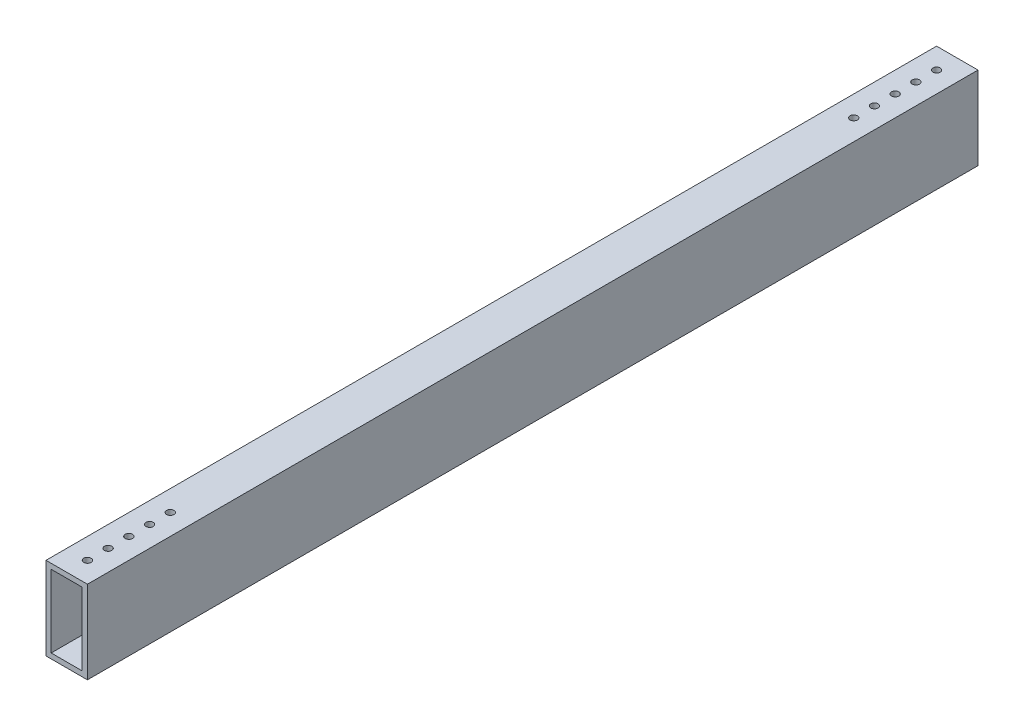
ISO-10303-21;
HEADER;
FILE_DESCRIPTION(('STEP AP214'),'2;1');
FILE_NAME('part.step','',(''),(''),'','','');
FILE_SCHEMA(('AUTOMOTIVE_DESIGN { 1 0 10303 214 1 1 1 1 }'));
ENDSEC;
DATA;
#1=APPLICATION_CONTEXT('core data for automotive mechanical design processes');
#2=APPLICATION_PROTOCOL_DEFINITION('international standard','automotive_design',2000,#1);
#3=PRODUCT_CONTEXT('',#1,'mechanical');
#4=PRODUCT('Part','Part','',(#3));
#5=PRODUCT_RELATED_PRODUCT_CATEGORY('part','',(#4));
#6=PRODUCT_DEFINITION_FORMATION('','',#4);
#7=PRODUCT_DEFINITION_CONTEXT('part definition',#1,'design');
#8=PRODUCT_DEFINITION('design','',#6,#7);
#9=PRODUCT_DEFINITION_SHAPE('','',#8);
#10=(LENGTH_UNIT() NAMED_UNIT(*) SI_UNIT(.MILLI.,.METRE.));
#11=(NAMED_UNIT(*) PLANE_ANGLE_UNIT() SI_UNIT($,.RADIAN.));
#12=(NAMED_UNIT(*) SI_UNIT($,.STERADIAN.) SOLID_ANGLE_UNIT());
#13=UNCERTAINTY_MEASURE_WITH_UNIT(LENGTH_MEASURE(1.E-05),#10,'distance_accuracy_value','');
#14=(GEOMETRIC_REPRESENTATION_CONTEXT(3) GLOBAL_UNCERTAINTY_ASSIGNED_CONTEXT((#13)) GLOBAL_UNIT_ASSIGNED_CONTEXT((#10,
#11,#12)) REPRESENTATION_CONTEXT('',''));
#15=CARTESIAN_POINT('',(0.,0.,0.));
#16=DIRECTION('',(0.,0.,1.));
#17=DIRECTION('',(1.,0.,0.));
#18=AXIS2_PLACEMENT_3D('',#15,#16,#17);
#19=CARTESIAN_POINT('',(0.,0.,273.05));
#20=DIRECTION('',(0.,0.,-1.));
#21=DIRECTION('',(-1.,0.,0.));
#22=AXIS2_PLACEMENT_3D('',#19,#20,#21);
#23=PLANE('',#22);
#24=DIRECTION('',(0.,-1.,0.));
#25=VECTOR('',#24,1.);
#26=CARTESIAN_POINT('',(0.,0.,273.05));
#27=LINE('',#26,#25);
#28=CARTESIAN_POINT('',(0.,50.8,273.05));
#29=VERTEX_POINT('',#28);
#30=CARTESIAN_POINT('',(0.,0.,273.05));
#31=VERTEX_POINT('',#30);
#32=EDGE_CURVE('E159',#29,#31,#27,.T.);
#33=ORIENTED_EDGE('',*,*,#32,.T.);
#34=DIRECTION('',(1.,0.,0.));
#35=VECTOR('',#34,1.);
#36=CARTESIAN_POINT('',(0.,0.,273.05));
#37=LINE('',#36,#35);
#38=CARTESIAN_POINT('',(25.4,0.,273.05));
#39=VERTEX_POINT('',#38);
#40=EDGE_CURVE('E163',#31,#39,#37,.T.);
#41=ORIENTED_EDGE('',*,*,#40,.T.);
#42=DIRECTION('',(0.,1.,0.));
#43=VECTOR('',#42,1.);
#44=CARTESIAN_POINT('',(25.4,0.,273.05));
#45=LINE('',#44,#43);
#46=CARTESIAN_POINT('',(25.4,50.8,273.05));
#47=VERTEX_POINT('',#46);
#48=EDGE_CURVE('E167',#39,#47,#45,.T.);
#49=ORIENTED_EDGE('',*,*,#48,.T.);
#50=DIRECTION('',(-1.,0.,0.));
#51=VECTOR('',#50,1.);
#52=CARTESIAN_POINT('',(0.,50.8,273.05));
#53=LINE('',#52,#51);
#54=EDGE_CURVE('E170',#47,#29,#53,.T.);
#55=ORIENTED_EDGE('',*,*,#54,.T.);
#56=EDGE_LOOP('',(#33,#41,#49,#55));
#57=FACE_BOUND('',#56,.T.);
#58=DIRECTION('',(0.,-1.,0.));
#59=VECTOR('',#58,1.);
#60=CARTESIAN_POINT('',(3.175,3.175,273.05));
#61=LINE('',#60,#59);
#62=CARTESIAN_POINT('',(3.175,47.625,273.05));
#63=VERTEX_POINT('',#62);
#64=CARTESIAN_POINT('',(3.175,3.175,273.05));
#65=VERTEX_POINT('',#64);
#66=EDGE_CURVE('E108',#63,#65,#61,.T.);
#67=ORIENTED_EDGE('',*,*,#66,.F.);
#68=DIRECTION('',(-1.,0.,0.));
#69=VECTOR('',#68,1.);
#70=CARTESIAN_POINT('',(3.175,47.625,273.05));
#71=LINE('',#70,#69);
#72=CARTESIAN_POINT('',(22.225,47.625,273.05));
#73=VERTEX_POINT('',#72);
#74=EDGE_CURVE('E135',#73,#63,#71,.T.);
#75=ORIENTED_EDGE('',*,*,#74,.F.);
#76=DIRECTION('',(0.,1.,0.));
#77=VECTOR('',#76,1.);
#78=CARTESIAN_POINT('',(22.225,3.175,273.05));
#79=LINE('',#78,#77);
#80=CARTESIAN_POINT('',(22.225,3.175,273.05));
#81=VERTEX_POINT('',#80);
#82=EDGE_CURVE('E130',#81,#73,#79,.T.);
#83=ORIENTED_EDGE('',*,*,#82,.F.);
#84=DIRECTION('',(1.,0.,0.));
#85=VECTOR('',#84,1.);
#86=CARTESIAN_POINT('',(3.175,3.175,273.05));
#87=LINE('',#86,#85);
#88=EDGE_CURVE('E117',#65,#81,#87,.T.);
#89=ORIENTED_EDGE('',*,*,#88,.F.);
#90=EDGE_LOOP('',(#67,#75,#83,#89));
#91=FACE_BOUND('',#90,.T.);
#92=ADVANCED_FACE('F40',(#57,#91),#23,.F.);
#93=CARTESIAN_POINT('',(0.,0.,-273.05));
#94=DIRECTION('',(0.,0.,-1.));
#95=DIRECTION('',(-1.,0.,0.));
#96=AXIS2_PLACEMENT_3D('',#93,#94,#95);
#97=PLANE('',#96);
#98=DIRECTION('',(0.,-1.,0.));
#99=VECTOR('',#98,1.);
#100=CARTESIAN_POINT('',(0.,0.,-273.05));
#101=LINE('',#100,#99);
#102=CARTESIAN_POINT('',(0.,50.8,-273.05));
#103=VERTEX_POINT('',#102);
#104=CARTESIAN_POINT('',(0.,0.,-273.05));
#105=VERTEX_POINT('',#104);
#106=EDGE_CURVE('E126',#103,#105,#101,.T.);
#107=ORIENTED_EDGE('',*,*,#106,.F.);
#108=DIRECTION('',(-1.,0.,0.));
#109=VECTOR('',#108,1.);
#110=CARTESIAN_POINT('',(0.,50.8,-273.05));
#111=LINE('',#110,#109);
#112=CARTESIAN_POINT('',(25.4,50.8,-273.05));
#113=VERTEX_POINT('',#112);
#114=EDGE_CURVE('E164',#113,#103,#111,.T.);
#115=ORIENTED_EDGE('',*,*,#114,.F.);
#116=DIRECTION('',(0.,1.,0.));
#117=VECTOR('',#116,1.);
#118=CARTESIAN_POINT('',(25.4,0.,-273.05));
#119=LINE('',#118,#117);
#120=CARTESIAN_POINT('',(25.4,0.,-273.05));
#121=VERTEX_POINT('',#120);
#122=EDGE_CURVE('E180',#121,#113,#119,.T.);
#123=ORIENTED_EDGE('',*,*,#122,.F.);
#124=DIRECTION('',(1.,0.,0.));
#125=VECTOR('',#124,1.);
#126=CARTESIAN_POINT('',(0.,0.,-273.05));
#127=LINE('',#126,#125);
#128=EDGE_CURVE('E177',#105,#121,#127,.T.);
#129=ORIENTED_EDGE('',*,*,#128,.F.);
#130=EDGE_LOOP('',(#107,#115,#123,#129));
#131=FACE_BOUND('',#130,.T.);
#132=DIRECTION('',(-1.,0.,0.));
#133=VECTOR('',#132,1.);
#134=CARTESIAN_POINT('',(3.175,47.625,-273.05));
#135=LINE('',#134,#133);
#136=CARTESIAN_POINT('',(22.225,47.625,-273.05));
#137=VERTEX_POINT('',#136);
#138=CARTESIAN_POINT('',(3.175,47.625,-273.05));
#139=VERTEX_POINT('',#138);
#140=EDGE_CURVE('E118',#137,#139,#135,.T.);
#141=ORIENTED_EDGE('',*,*,#140,.T.);
#142=DIRECTION('',(0.,-1.,0.));
#143=VECTOR('',#142,1.);
#144=CARTESIAN_POINT('',(3.175,3.175,-273.05));
#145=LINE('',#144,#143);
#146=CARTESIAN_POINT('',(3.175,3.175,-273.05));
#147=VERTEX_POINT('',#146);
#148=EDGE_CURVE('E66',#139,#147,#145,.T.);
#149=ORIENTED_EDGE('',*,*,#148,.T.);
#150=DIRECTION('',(1.,0.,0.));
#151=VECTOR('',#150,1.);
#152=CARTESIAN_POINT('',(3.175,3.175,-273.05));
#153=LINE('',#152,#151);
#154=CARTESIAN_POINT('',(22.225,3.175,-273.05));
#155=VERTEX_POINT('',#154);
#156=EDGE_CURVE('E124',#147,#155,#153,.T.);
#157=ORIENTED_EDGE('',*,*,#156,.T.);
#158=DIRECTION('',(0.,1.,0.));
#159=VECTOR('',#158,1.);
#160=CARTESIAN_POINT('',(22.225,3.175,-273.05));
#161=LINE('',#160,#159);
#162=EDGE_CURVE('E146',#155,#137,#161,.T.);
#163=ORIENTED_EDGE('',*,*,#162,.T.);
#164=EDGE_LOOP('',(#141,#149,#157,#163));
#165=FACE_BOUND('',#164,.T.);
#166=ADVANCED_FACE('F318',(#131,#165),#97,.T.);
#167=CARTESIAN_POINT('',(0.,0.,273.05));
#168=DIRECTION('',(1.,0.,0.));
#169=DIRECTION('',(0.,0.,-1.));
#170=AXIS2_PLACEMENT_3D('',#167,#168,#169);
#171=PLANE('',#170);
#172=ORIENTED_EDGE('',*,*,#106,.T.);
#173=DIRECTION('',(0.,0.,-1.));
#174=VECTOR('',#173,1.);
#175=CARTESIAN_POINT('',(0.,0.,273.05));
#176=LINE('',#175,#174);
#177=EDGE_CURVE('E11',#31,#105,#176,.T.);
#178=ORIENTED_EDGE('',*,*,#177,.F.);
#179=ORIENTED_EDGE('',*,*,#32,.F.);
#180=DIRECTION('',(0.,0.,-1.));
#181=VECTOR('',#180,1.);
#182=CARTESIAN_POINT('',(0.,50.8,273.05));
#183=LINE('',#182,#181);
#184=EDGE_CURVE('E173',#29,#103,#183,.T.);
#185=ORIENTED_EDGE('',*,*,#184,.T.);
#186=EDGE_LOOP('',(#172,#178,#179,#185));
#187=FACE_BOUND('',#186,.T.);
#188=ADVANCED_FACE('F42',(#187),#171,.F.);
#189=CARTESIAN_POINT('',(0.,0.,273.05));
#190=DIRECTION('',(0.,1.,0.));
#191=DIRECTION('',(0.,0.,1.));
#192=AXIS2_PLACEMENT_3D('',#189,#190,#191);
#193=PLANE('',#192);
#194=CARTESIAN_POINT('',(12.7,0.,260.35));
#195=DIRECTION('',(0.,-1.,0.));
#196=DIRECTION('',(0.,0.,-1.));
#197=AXIS2_PLACEMENT_3D('',#194,#195,#196);
#198=CIRCLE('',#197,2.24789999999998);
#199=CARTESIAN_POINT('',(12.7,0.,258.1021));
#200=VERTEX_POINT('',#199);
#201=EDGE_CURVE('E275',#200,#200,#198,.T.);
#202=ORIENTED_EDGE('',*,*,#201,.F.);
#203=EDGE_LOOP('',(#202));
#204=FACE_BOUND('',#203,.T.);
#205=CARTESIAN_POINT('',(12.7,0.,234.95));
#206=DIRECTION('',(0.,-1.,0.));
#207=DIRECTION('',(0.,0.,-1.));
#208=AXIS2_PLACEMENT_3D('',#205,#206,#207);
#209=CIRCLE('',#208,2.24789999999998);
#210=CARTESIAN_POINT('',(12.7,0.,232.7021));
#211=VERTEX_POINT('',#210);
#212=EDGE_CURVE('E253',#211,#211,#209,.T.);
#213=ORIENTED_EDGE('',*,*,#212,.F.);
#214=EDGE_LOOP('',(#213));
#215=FACE_BOUND('',#214,.T.);
#216=CARTESIAN_POINT('',(12.7,0.,209.55));
#217=DIRECTION('',(0.,-1.,0.));
#218=DIRECTION('',(0.,0.,-1.));
#219=AXIS2_PLACEMENT_3D('',#216,#217,#218);
#220=CIRCLE('',#219,2.24789999999998);
#221=CARTESIAN_POINT('',(12.7,0.,207.3021));
#222=VERTEX_POINT('',#221);
#223=EDGE_CURVE('E243',#222,#222,#220,.T.);
#224=ORIENTED_EDGE('',*,*,#223,.F.);
#225=EDGE_LOOP('',(#224));
#226=FACE_BOUND('',#225,.T.);
#227=CARTESIAN_POINT('',(12.7,0.,-260.35));
#228=DIRECTION('',(0.,1.,0.));
#229=DIRECTION('',(0.,0.,1.));
#230=AXIS2_PLACEMENT_3D('',#227,#228,#229);
#231=CIRCLE('',#230,2.24789999999998);
#232=CARTESIAN_POINT('',(12.7,0.,-258.1021));
#233=VERTEX_POINT('',#232);
#234=EDGE_CURVE('E276',#233,#233,#231,.T.);
#235=ORIENTED_EDGE('',*,*,#234,.T.);
#236=EDGE_LOOP('',(#235));
#237=FACE_BOUND('',#236,.T.);
#238=CARTESIAN_POINT('',(12.7,0.,-234.95));
#239=DIRECTION('',(0.,1.,0.));
#240=DIRECTION('',(0.,0.,1.));
#241=AXIS2_PLACEMENT_3D('',#238,#239,#240);
#242=CIRCLE('',#241,2.24789999999998);
#243=CARTESIAN_POINT('',(12.7,0.,-232.7021));
#244=VERTEX_POINT('',#243);
#245=EDGE_CURVE('E284',#244,#244,#242,.T.);
#246=ORIENTED_EDGE('',*,*,#245,.T.);
#247=EDGE_LOOP('',(#246));
#248=FACE_BOUND('',#247,.T.);
#249=CARTESIAN_POINT('',(12.7,0.,-209.55));
#250=DIRECTION('',(0.,1.,0.));
#251=DIRECTION('',(0.,0.,1.));
#252=AXIS2_PLACEMENT_3D('',#249,#250,#251);
#253=CIRCLE('',#252,2.24789999999998);
#254=CARTESIAN_POINT('',(12.7,0.,-207.3021));
#255=VERTEX_POINT('',#254);
#256=EDGE_CURVE('E216',#255,#255,#253,.T.);
#257=ORIENTED_EDGE('',*,*,#256,.T.);
#258=EDGE_LOOP('',(#257));
#259=FACE_BOUND('',#258,.T.);
#260=ORIENTED_EDGE('',*,*,#128,.T.);
#261=DIRECTION('',(0.,0.,-1.));
#262=VECTOR('',#261,1.);
#263=CARTESIAN_POINT('',(25.4,0.,273.05));
#264=LINE('',#263,#262);
#265=EDGE_CURVE('E50',#39,#121,#264,.T.);
#266=ORIENTED_EDGE('',*,*,#265,.F.);
#267=ORIENTED_EDGE('',*,*,#40,.F.);
#268=ORIENTED_EDGE('',*,*,#177,.T.);
#269=EDGE_LOOP('',(#260,#266,#267,#268));
#270=FACE_BOUND('',#269,.T.);
#271=ADVANCED_FACE('F332',(#204,#215,#226,#237,#248,#259,#270),#193,.F.);
#272=CARTESIAN_POINT('',(25.4,0.,273.05));
#273=DIRECTION('',(-1.,0.,0.));
#274=DIRECTION('',(0.,0.,1.));
#275=AXIS2_PLACEMENT_3D('',#272,#273,#274);
#276=PLANE('',#275);
#277=ORIENTED_EDGE('',*,*,#122,.T.);
#278=DIRECTION('',(0.,0.,-1.));
#279=VECTOR('',#278,1.);
#280=CARTESIAN_POINT('',(25.4,50.8,273.05));
#281=LINE('',#280,#279);
#282=EDGE_CURVE('E188',#47,#113,#281,.T.);
#283=ORIENTED_EDGE('',*,*,#282,.F.);
#284=ORIENTED_EDGE('',*,*,#48,.F.);
#285=ORIENTED_EDGE('',*,*,#265,.T.);
#286=EDGE_LOOP('',(#277,#283,#284,#285));
#287=FACE_BOUND('',#286,.T.);
#288=ADVANCED_FACE('F329',(#287),#276,.F.);
#289=CARTESIAN_POINT('',(0.,50.8,273.05));
#290=DIRECTION('',(0.,-1.,0.));
#291=DIRECTION('',(0.,0.,-1.));
#292=AXIS2_PLACEMENT_3D('',#289,#290,#291);
#293=PLANE('',#292);
#294=CARTESIAN_POINT('',(12.7,50.8,260.35));
#295=DIRECTION('',(0.,1.,0.));
#296=DIRECTION('',(0.,0.,1.));
#297=AXIS2_PLACEMENT_3D('',#294,#295,#296);
#298=CIRCLE('',#297,2.24789999999998);
#299=CARTESIAN_POINT('',(12.7,50.8,262.5979));
#300=VERTEX_POINT('',#299);
#301=EDGE_CURVE('E222',#300,#300,#298,.T.);
#302=ORIENTED_EDGE('',*,*,#301,.F.);
#303=EDGE_LOOP('',(#302));
#304=FACE_BOUND('',#303,.T.);
#305=CARTESIAN_POINT('',(12.7,50.8,247.65));
#306=DIRECTION('',(0.,1.,0.));
#307=DIRECTION('',(0.,0.,1.));
#308=AXIS2_PLACEMENT_3D('',#305,#306,#307);
#309=CIRCLE('',#308,2.24789999999998);
#310=CARTESIAN_POINT('',(12.7,50.8,249.8979));
#311=VERTEX_POINT('',#310);
#312=EDGE_CURVE('E439',#311,#311,#309,.T.);
#313=ORIENTED_EDGE('',*,*,#312,.F.);
#314=EDGE_LOOP('',(#313));
#315=FACE_BOUND('',#314,.T.);
#316=CARTESIAN_POINT('',(12.7,50.8,234.95));
#317=DIRECTION('',(0.,1.,0.));
#318=DIRECTION('',(0.,0.,1.));
#319=AXIS2_PLACEMENT_3D('',#316,#317,#318);
#320=CIRCLE('',#319,2.24789999999998);
#321=CARTESIAN_POINT('',(12.7,50.8,237.1979));
#322=VERTEX_POINT('',#321);
#323=EDGE_CURVE('E444',#322,#322,#320,.T.);
#324=ORIENTED_EDGE('',*,*,#323,.F.);
#325=EDGE_LOOP('',(#324));
#326=FACE_BOUND('',#325,.T.);
#327=CARTESIAN_POINT('',(12.7,50.8,222.25));
#328=DIRECTION('',(0.,1.,0.));
#329=DIRECTION('',(0.,0.,1.));
#330=AXIS2_PLACEMENT_3D('',#327,#328,#329);
#331=CIRCLE('',#330,2.24789999999998);
#332=CARTESIAN_POINT('',(12.7,50.8,224.4979));
#333=VERTEX_POINT('',#332);
#334=EDGE_CURVE('E450',#333,#333,#331,.T.);
#335=ORIENTED_EDGE('',*,*,#334,.F.);
#336=EDGE_LOOP('',(#335));
#337=FACE_BOUND('',#336,.T.);
#338=CARTESIAN_POINT('',(12.7,50.8,209.55));
#339=DIRECTION('',(0.,1.,0.));
#340=DIRECTION('',(0.,0.,1.));
#341=AXIS2_PLACEMENT_3D('',#338,#339,#340);
#342=CIRCLE('',#341,2.24789999999998);
#343=CARTESIAN_POINT('',(12.7,50.8,211.7979));
#344=VERTEX_POINT('',#343);
#345=EDGE_CURVE('E454',#344,#344,#342,.T.);
#346=ORIENTED_EDGE('',*,*,#345,.F.);
#347=EDGE_LOOP('',(#346));
#348=FACE_BOUND('',#347,.T.);
#349=CARTESIAN_POINT('',(12.7,50.8,-260.35));
#350=DIRECTION('',(0.,1.,0.));
#351=DIRECTION('',(0.,0.,1.));
#352=AXIS2_PLACEMENT_3D('',#349,#350,#351);
#353=CIRCLE('',#352,2.24789999999998);
#354=CARTESIAN_POINT('',(12.7,50.8,-258.1021));
#355=VERTEX_POINT('',#354);
#356=EDGE_CURVE('E200',#355,#355,#353,.T.);
#357=ORIENTED_EDGE('',*,*,#356,.F.);
#358=EDGE_LOOP('',(#357));
#359=FACE_BOUND('',#358,.T.);
#360=CARTESIAN_POINT('',(12.7,50.8,-247.65));
#361=DIRECTION('',(0.,1.,0.));
#362=DIRECTION('',(0.,0.,1.));
#363=AXIS2_PLACEMENT_3D('',#360,#361,#362);
#364=CIRCLE('',#363,2.24789999999998);
#365=CARTESIAN_POINT('',(12.7,50.8,-245.4021));
#366=VERTEX_POINT('',#365);
#367=EDGE_CURVE('E259',#366,#366,#364,.T.);
#368=ORIENTED_EDGE('',*,*,#367,.F.);
#369=EDGE_LOOP('',(#368));
#370=FACE_BOUND('',#369,.T.);
#371=CARTESIAN_POINT('',(12.7,50.8,-234.95));
#372=DIRECTION('',(0.,1.,0.));
#373=DIRECTION('',(0.,0.,1.));
#374=AXIS2_PLACEMENT_3D('',#371,#372,#373);
#375=CIRCLE('',#374,2.24789999999998);
#376=CARTESIAN_POINT('',(12.7,50.8,-232.7021));
#377=VERTEX_POINT('',#376);
#378=EDGE_CURVE('E263',#377,#377,#375,.T.);
#379=ORIENTED_EDGE('',*,*,#378,.F.);
#380=EDGE_LOOP('',(#379));
#381=FACE_BOUND('',#380,.T.);
#382=CARTESIAN_POINT('',(12.7,50.8,-222.25));
#383=DIRECTION('',(0.,1.,0.));
#384=DIRECTION('',(0.,0.,1.));
#385=AXIS2_PLACEMENT_3D('',#382,#383,#384);
#386=CIRCLE('',#385,2.24789999999998);
#387=CARTESIAN_POINT('',(12.7,50.8,-220.0021));
#388=VERTEX_POINT('',#387);
#389=EDGE_CURVE('E267',#388,#388,#386,.T.);
#390=ORIENTED_EDGE('',*,*,#389,.F.);
#391=EDGE_LOOP('',(#390));
#392=FACE_BOUND('',#391,.T.);
#393=CARTESIAN_POINT('',(12.7,50.8,-209.55));
#394=DIRECTION('',(0.,1.,0.));
#395=DIRECTION('',(0.,0.,1.));
#396=AXIS2_PLACEMENT_3D('',#393,#394,#395);
#397=CIRCLE('',#396,2.24789999999998);
#398=CARTESIAN_POINT('',(12.7,50.8,-207.3021));
#399=VERTEX_POINT('',#398);
#400=EDGE_CURVE('E271',#399,#399,#397,.T.);
#401=ORIENTED_EDGE('',*,*,#400,.F.);
#402=EDGE_LOOP('',(#401));
#403=FACE_BOUND('',#402,.T.);
#404=ORIENTED_EDGE('',*,*,#114,.T.);
#405=ORIENTED_EDGE('',*,*,#184,.F.);
#406=ORIENTED_EDGE('',*,*,#54,.F.);
#407=ORIENTED_EDGE('',*,*,#282,.T.);
#408=EDGE_LOOP('',(#404,#405,#406,#407));
#409=FACE_BOUND('',#408,.T.);
#410=ADVANCED_FACE('F313',(#304,#315,#326,#337,#348,#359,#370,#381,#392,#403,#409),#293,.F.);
#411=CARTESIAN_POINT('',(3.175,3.175,273.05));
#412=DIRECTION('',(1.,0.,0.));
#413=DIRECTION('',(0.,0.,-1.));
#414=AXIS2_PLACEMENT_3D('',#411,#412,#413);
#415=PLANE('',#414);
#416=ORIENTED_EDGE('',*,*,#148,.F.);
#417=DIRECTION('',(0.,0.,-1.));
#418=VECTOR('',#417,1.);
#419=CARTESIAN_POINT('',(3.175,47.625,273.05));
#420=LINE('',#419,#418);
#421=EDGE_CURVE('E112',#63,#139,#420,.T.);
#422=ORIENTED_EDGE('',*,*,#421,.F.);
#423=ORIENTED_EDGE('',*,*,#66,.T.);
#424=DIRECTION('',(0.,0.,-1.));
#425=VECTOR('',#424,1.);
#426=CARTESIAN_POINT('',(3.175,3.175,273.05));
#427=LINE('',#426,#425);
#428=EDGE_CURVE('E111',#65,#147,#427,.T.);
#429=ORIENTED_EDGE('',*,*,#428,.T.);
#430=EDGE_LOOP('',(#416,#422,#423,#429));
#431=FACE_BOUND('',#430,.T.);
#432=ADVANCED_FACE('F110',(#431),#415,.T.);
#433=CARTESIAN_POINT('',(3.175,3.175,273.05));
#434=DIRECTION('',(0.,1.,0.));
#435=DIRECTION('',(0.,0.,1.));
#436=AXIS2_PLACEMENT_3D('',#433,#434,#435);
#437=PLANE('',#436);
#438=CARTESIAN_POINT('',(12.7,3.175,260.35));
#439=DIRECTION('',(0.,1.,0.));
#440=DIRECTION('',(0.,0.,1.));
#441=AXIS2_PLACEMENT_3D('',#438,#439,#440);
#442=CIRCLE('',#441,2.24789999999998);
#443=CARTESIAN_POINT('',(12.7,3.175,262.5979));
#444=VERTEX_POINT('',#443);
#445=EDGE_CURVE('E458',#444,#444,#442,.F.);
#446=ORIENTED_EDGE('',*,*,#445,.T.);
#447=EDGE_LOOP('',(#446));
#448=FACE_BOUND('',#447,.T.);
#449=CARTESIAN_POINT('',(12.7,3.175,234.95));
#450=DIRECTION('',(0.,1.,0.));
#451=DIRECTION('',(0.,0.,1.));
#452=AXIS2_PLACEMENT_3D('',#449,#450,#451);
#453=CIRCLE('',#452,2.24789999999998);
#454=CARTESIAN_POINT('',(12.7,3.175,237.1979));
#455=VERTEX_POINT('',#454);
#456=EDGE_CURVE('E250',#455,#455,#453,.F.);
#457=ORIENTED_EDGE('',*,*,#456,.T.);
#458=EDGE_LOOP('',(#457));
#459=FACE_BOUND('',#458,.T.);
#460=CARTESIAN_POINT('',(12.7,3.175,209.55));
#461=DIRECTION('',(0.,1.,0.));
#462=DIRECTION('',(0.,0.,1.));
#463=AXIS2_PLACEMENT_3D('',#460,#461,#462);
#464=CIRCLE('',#463,2.24789999999998);
#465=CARTESIAN_POINT('',(12.7,3.175,211.7979));
#466=VERTEX_POINT('',#465);
#467=EDGE_CURVE('E237',#466,#466,#464,.F.);
#468=ORIENTED_EDGE('',*,*,#467,.T.);
#469=EDGE_LOOP('',(#468));
#470=FACE_BOUND('',#469,.T.);
#471=CARTESIAN_POINT('',(12.7,3.175,-260.35));
#472=DIRECTION('',(0.,1.,0.));
#473=DIRECTION('',(0.,0.,1.));
#474=AXIS2_PLACEMENT_3D('',#471,#472,#473);
#475=CIRCLE('',#474,2.24789999999998);
#476=CARTESIAN_POINT('',(12.7,3.175,-258.1021));
#477=VERTEX_POINT('',#476);
#478=EDGE_CURVE('E143',#477,#477,#475,.T.);
#479=ORIENTED_EDGE('',*,*,#478,.F.);
#480=EDGE_LOOP('',(#479));
#481=FACE_BOUND('',#480,.T.);
#482=CARTESIAN_POINT('',(12.7,3.175,-234.95));
#483=DIRECTION('',(0.,1.,0.));
#484=DIRECTION('',(0.,0.,1.));
#485=AXIS2_PLACEMENT_3D('',#482,#483,#484);
#486=CIRCLE('',#485,2.24789999999998);
#487=CARTESIAN_POINT('',(12.7,3.175,-232.7021));
#488=VERTEX_POINT('',#487);
#489=EDGE_CURVE('E280',#488,#488,#486,.T.);
#490=ORIENTED_EDGE('',*,*,#489,.F.);
#491=EDGE_LOOP('',(#490));
#492=FACE_BOUND('',#491,.T.);
#493=CARTESIAN_POINT('',(12.7,3.175,-209.55));
#494=DIRECTION('',(0.,1.,0.));
#495=DIRECTION('',(0.,0.,1.));
#496=AXIS2_PLACEMENT_3D('',#493,#494,#495);
#497=CIRCLE('',#496,2.24789999999998);
#498=CARTESIAN_POINT('',(12.7,3.175,-207.3021));
#499=VERTEX_POINT('',#498);
#500=EDGE_CURVE('E288',#499,#499,#497,.T.);
#501=ORIENTED_EDGE('',*,*,#500,.F.);
#502=EDGE_LOOP('',(#501));
#503=FACE_BOUND('',#502,.T.);
#504=ORIENTED_EDGE('',*,*,#156,.F.);
#505=ORIENTED_EDGE('',*,*,#428,.F.);
#506=ORIENTED_EDGE('',*,*,#88,.T.);
#507=DIRECTION('',(0.,0.,-1.));
#508=VECTOR('',#507,1.);
#509=CARTESIAN_POINT('',(22.225,3.175,273.05));
#510=LINE('',#509,#508);
#511=EDGE_CURVE('E127',#81,#155,#510,.T.);
#512=ORIENTED_EDGE('',*,*,#511,.T.);
#513=EDGE_LOOP('',(#504,#505,#506,#512));
#514=FACE_BOUND('',#513,.T.);
#515=ADVANCED_FACE('F121',(#448,#459,#470,#481,#492,#503,#514),#437,.T.);
#516=CARTESIAN_POINT('',(22.225,3.175,273.05));
#517=DIRECTION('',(-1.,0.,0.));
#518=DIRECTION('',(0.,0.,1.));
#519=AXIS2_PLACEMENT_3D('',#516,#517,#518);
#520=PLANE('',#519);
#521=ORIENTED_EDGE('',*,*,#162,.F.);
#522=ORIENTED_EDGE('',*,*,#511,.F.);
#523=ORIENTED_EDGE('',*,*,#82,.T.);
#524=DIRECTION('',(0.,0.,-1.));
#525=VECTOR('',#524,1.);
#526=CARTESIAN_POINT('',(22.225,47.625,273.05));
#527=LINE('',#526,#525);
#528=EDGE_CURVE('E58',#73,#137,#527,.T.);
#529=ORIENTED_EDGE('',*,*,#528,.T.);
#530=EDGE_LOOP('',(#521,#522,#523,#529));
#531=FACE_BOUND('',#530,.T.);
#532=ADVANCED_FACE('F303',(#531),#520,.T.);
#533=CARTESIAN_POINT('',(3.175,47.625,273.05));
#534=DIRECTION('',(0.,-1.,0.));
#535=DIRECTION('',(0.,0.,-1.));
#536=AXIS2_PLACEMENT_3D('',#533,#534,#535);
#537=PLANE('',#536);
#538=CARTESIAN_POINT('',(12.7,47.625,260.35));
#539=DIRECTION('',(0.,-1.,0.));
#540=DIRECTION('',(0.,0.,-1.));
#541=AXIS2_PLACEMENT_3D('',#538,#539,#540);
#542=CIRCLE('',#541,2.24789999999998);
#543=CARTESIAN_POINT('',(12.7,47.625,258.1021));
#544=VERTEX_POINT('',#543);
#545=EDGE_CURVE('E44',#544,#544,#542,.F.);
#546=ORIENTED_EDGE('',*,*,#545,.T.);
#547=EDGE_LOOP('',(#546));
#548=FACE_BOUND('',#547,.T.);
#549=CARTESIAN_POINT('',(12.7,47.625,247.65));
#550=DIRECTION('',(0.,-1.,0.));
#551=DIRECTION('',(0.,0.,-1.));
#552=AXIS2_PLACEMENT_3D('',#549,#550,#551);
#553=CIRCLE('',#552,2.24789999999998);
#554=CARTESIAN_POINT('',(12.7,47.625,245.4021));
#555=VERTEX_POINT('',#554);
#556=EDGE_CURVE('E229',#555,#555,#553,.F.);
#557=ORIENTED_EDGE('',*,*,#556,.T.);
#558=EDGE_LOOP('',(#557));
#559=FACE_BOUND('',#558,.T.);
#560=CARTESIAN_POINT('',(12.7,47.625,234.95));
#561=DIRECTION('',(0.,-1.,0.));
#562=DIRECTION('',(0.,0.,-1.));
#563=AXIS2_PLACEMENT_3D('',#560,#561,#562);
#564=CIRCLE('',#563,2.24789999999998);
#565=CARTESIAN_POINT('',(12.7,47.625,232.7021));
#566=VERTEX_POINT('',#565);
#567=EDGE_CURVE('E226',#566,#566,#564,.F.);
#568=ORIENTED_EDGE('',*,*,#567,.T.);
#569=EDGE_LOOP('',(#568));
#570=FACE_BOUND('',#569,.T.);
#571=CARTESIAN_POINT('',(12.7,47.625,222.25));
#572=DIRECTION('',(0.,-1.,0.));
#573=DIRECTION('',(0.,0.,-1.));
#574=AXIS2_PLACEMENT_3D('',#571,#572,#573);
#575=CIRCLE('',#574,2.24789999999998);
#576=CARTESIAN_POINT('',(12.7,47.625,220.0021));
#577=VERTEX_POINT('',#576);
#578=EDGE_CURVE('E221',#577,#577,#575,.F.);
#579=ORIENTED_EDGE('',*,*,#578,.T.);
#580=EDGE_LOOP('',(#579));
#581=FACE_BOUND('',#580,.T.);
#582=CARTESIAN_POINT('',(12.7,47.625,209.55));
#583=DIRECTION('',(0.,-1.,0.));
#584=DIRECTION('',(0.,0.,-1.));
#585=AXIS2_PLACEMENT_3D('',#582,#583,#584);
#586=CIRCLE('',#585,2.24789999999998);
#587=CARTESIAN_POINT('',(12.7,47.625,207.3021));
#588=VERTEX_POINT('',#587);
#589=EDGE_CURVE('E217',#588,#588,#586,.F.);
#590=ORIENTED_EDGE('',*,*,#589,.T.);
#591=EDGE_LOOP('',(#590));
#592=FACE_BOUND('',#591,.T.);
#593=CARTESIAN_POINT('',(12.7,47.625,-260.35));
#594=DIRECTION('',(0.,-1.,0.));
#595=DIRECTION('',(0.,0.,-1.));
#596=AXIS2_PLACEMENT_3D('',#593,#594,#595);
#597=CIRCLE('',#596,2.24789999999998);
#598=CARTESIAN_POINT('',(12.7,47.625,-262.5979));
#599=VERTEX_POINT('',#598);
#600=EDGE_CURVE('E212',#599,#599,#597,.F.);
#601=ORIENTED_EDGE('',*,*,#600,.T.);
#602=EDGE_LOOP('',(#601));
#603=FACE_BOUND('',#602,.T.);
#604=CARTESIAN_POINT('',(12.7,47.625,-247.65));
#605=DIRECTION('',(0.,-1.,0.));
#606=DIRECTION('',(0.,0.,-1.));
#607=AXIS2_PLACEMENT_3D('',#604,#605,#606);
#608=CIRCLE('',#607,2.24789999999998);
#609=CARTESIAN_POINT('',(12.7,47.625,-249.8979));
#610=VERTEX_POINT('',#609);
#611=EDGE_CURVE('E208',#610,#610,#608,.F.);
#612=ORIENTED_EDGE('',*,*,#611,.T.);
#613=EDGE_LOOP('',(#612));
#614=FACE_BOUND('',#613,.T.);
#615=CARTESIAN_POINT('',(12.7,47.625,-234.95));
#616=DIRECTION('',(0.,-1.,0.));
#617=DIRECTION('',(0.,0.,-1.));
#618=AXIS2_PLACEMENT_3D('',#615,#616,#617);
#619=CIRCLE('',#618,2.24789999999998);
#620=CARTESIAN_POINT('',(12.7,47.625,-237.1979));
#621=VERTEX_POINT('',#620);
#622=EDGE_CURVE('E204',#621,#621,#619,.F.);
#623=ORIENTED_EDGE('',*,*,#622,.T.);
#624=EDGE_LOOP('',(#623));
#625=FACE_BOUND('',#624,.T.);
#626=CARTESIAN_POINT('',(12.7,47.625,-222.25));
#627=DIRECTION('',(0.,-1.,0.));
#628=DIRECTION('',(0.,0.,-1.));
#629=AXIS2_PLACEMENT_3D('',#626,#627,#628);
#630=CIRCLE('',#629,2.24789999999998);
#631=CARTESIAN_POINT('',(12.7,47.625,-224.4979));
#632=VERTEX_POINT('',#631);
#633=EDGE_CURVE('E199',#632,#632,#630,.F.);
#634=ORIENTED_EDGE('',*,*,#633,.T.);
#635=EDGE_LOOP('',(#634));
#636=FACE_BOUND('',#635,.T.);
#637=CARTESIAN_POINT('',(12.7,47.625,-209.55));
#638=DIRECTION('',(0.,-1.,0.));
#639=DIRECTION('',(0.,0.,-1.));
#640=AXIS2_PLACEMENT_3D('',#637,#638,#639);
#641=CIRCLE('',#640,2.24789999999998);
#642=CARTESIAN_POINT('',(12.7,47.625,-211.7979));
#643=VERTEX_POINT('',#642);
#644=EDGE_CURVE('E195',#643,#643,#641,.F.);
#645=ORIENTED_EDGE('',*,*,#644,.T.);
#646=EDGE_LOOP('',(#645));
#647=FACE_BOUND('',#646,.T.);
#648=ORIENTED_EDGE('',*,*,#140,.F.);
#649=ORIENTED_EDGE('',*,*,#528,.F.);
#650=ORIENTED_EDGE('',*,*,#74,.T.);
#651=ORIENTED_EDGE('',*,*,#421,.T.);
#652=EDGE_LOOP('',(#648,#649,#650,#651));
#653=FACE_BOUND('',#652,.T.);
#654=ADVANCED_FACE('F310',(#548,#559,#570,#581,#592,#603,#614,#625,#636,#647,#653),#537,.T.);
#655=CARTESIAN_POINT('',(12.7,50.801,-209.55));
#656=DIRECTION('',(0.,-1.,0.));
#657=DIRECTION('',(0.,0.,-1.));
#658=AXIS2_PLACEMENT_3D('',#655,#656,#657);
#659=CYLINDRICAL_SURFACE('',#658,2.24789999999998);
#660=ORIENTED_EDGE('',*,*,#500,.T.);
#661=EDGE_LOOP('',(#660));
#662=FACE_BOUND('',#661,.T.);
#663=ORIENTED_EDGE('',*,*,#256,.F.);
#664=EDGE_LOOP('',(#663));
#665=FACE_BOUND('',#664,.T.);
#666=ADVANCED_FACE('F299',(#662,#665),#659,.F.);
#667=CARTESIAN_POINT('',(12.7,50.801,-234.95));
#668=DIRECTION('',(0.,-1.,0.));
#669=DIRECTION('',(0.,0.,-1.));
#670=AXIS2_PLACEMENT_3D('',#667,#668,#669);
#671=CYLINDRICAL_SURFACE('',#670,2.24789999999998);
#672=ORIENTED_EDGE('',*,*,#489,.T.);
#673=EDGE_LOOP('',(#672));
#674=FACE_BOUND('',#673,.T.);
#675=ORIENTED_EDGE('',*,*,#245,.F.);
#676=EDGE_LOOP('',(#675));
#677=FACE_BOUND('',#676,.T.);
#678=ADVANCED_FACE('F372',(#674,#677),#671,.F.);
#679=CARTESIAN_POINT('',(12.7,50.801,-260.35));
#680=DIRECTION('',(0.,-1.,0.));
#681=DIRECTION('',(0.,0.,-1.));
#682=AXIS2_PLACEMENT_3D('',#679,#680,#681);
#683=CYLINDRICAL_SURFACE('',#682,2.24789999999998);
#684=ORIENTED_EDGE('',*,*,#478,.T.);
#685=EDGE_LOOP('',(#684));
#686=FACE_BOUND('',#685,.T.);
#687=ORIENTED_EDGE('',*,*,#234,.F.);
#688=EDGE_LOOP('',(#687));
#689=FACE_BOUND('',#688,.T.);
#690=ADVANCED_FACE('F377',(#686,#689),#683,.F.);
#691=CARTESIAN_POINT('',(12.7,50.8,-209.55));
#692=DIRECTION('',(0.,-1.,0.));
#693=DIRECTION('',(0.,0.,-1.));
#694=AXIS2_PLACEMENT_3D('',#691,#692,#693);
#695=CYLINDRICAL_SURFACE('',#694,2.24789999999998);
#696=ORIENTED_EDGE('',*,*,#644,.F.);
#697=EDGE_LOOP('',(#696));
#698=FACE_BOUND('',#697,.T.);
#699=ORIENTED_EDGE('',*,*,#400,.T.);
#700=EDGE_LOOP('',(#699));
#701=FACE_BOUND('',#700,.T.);
#702=ADVANCED_FACE('F381',(#698,#701),#695,.F.);
#703=CARTESIAN_POINT('',(12.7,50.8,-222.25));
#704=DIRECTION('',(0.,-1.,0.));
#705=DIRECTION('',(0.,0.,-1.));
#706=AXIS2_PLACEMENT_3D('',#703,#704,#705);
#707=CYLINDRICAL_SURFACE('',#706,2.24789999999998);
#708=ORIENTED_EDGE('',*,*,#633,.F.);
#709=EDGE_LOOP('',(#708));
#710=FACE_BOUND('',#709,.T.);
#711=ORIENTED_EDGE('',*,*,#389,.T.);
#712=EDGE_LOOP('',(#711));
#713=FACE_BOUND('',#712,.T.);
#714=ADVANCED_FACE('F385',(#710,#713),#707,.F.);
#715=CARTESIAN_POINT('',(12.7,50.8,-234.95));
#716=DIRECTION('',(0.,-1.,0.));
#717=DIRECTION('',(0.,0.,-1.));
#718=AXIS2_PLACEMENT_3D('',#715,#716,#717);
#719=CYLINDRICAL_SURFACE('',#718,2.24789999999998);
#720=ORIENTED_EDGE('',*,*,#622,.F.);
#721=EDGE_LOOP('',(#720));
#722=FACE_BOUND('',#721,.T.);
#723=ORIENTED_EDGE('',*,*,#378,.T.);
#724=EDGE_LOOP('',(#723));
#725=FACE_BOUND('',#724,.T.);
#726=ADVANCED_FACE('F389',(#722,#725),#719,.F.);
#727=CARTESIAN_POINT('',(12.7,50.8,-247.65));
#728=DIRECTION('',(0.,-1.,0.));
#729=DIRECTION('',(0.,0.,-1.));
#730=AXIS2_PLACEMENT_3D('',#727,#728,#729);
#731=CYLINDRICAL_SURFACE('',#730,2.24789999999998);
#732=ORIENTED_EDGE('',*,*,#611,.F.);
#733=EDGE_LOOP('',(#732));
#734=FACE_BOUND('',#733,.T.);
#735=ORIENTED_EDGE('',*,*,#367,.T.);
#736=EDGE_LOOP('',(#735));
#737=FACE_BOUND('',#736,.T.);
#738=ADVANCED_FACE('F393',(#734,#737),#731,.F.);
#739=CARTESIAN_POINT('',(12.7,50.8,-260.35));
#740=DIRECTION('',(0.,-1.,0.));
#741=DIRECTION('',(0.,0.,-1.));
#742=AXIS2_PLACEMENT_3D('',#739,#740,#741);
#743=CYLINDRICAL_SURFACE('',#742,2.24789999999998);
#744=ORIENTED_EDGE('',*,*,#600,.F.);
#745=EDGE_LOOP('',(#744));
#746=FACE_BOUND('',#745,.T.);
#747=ORIENTED_EDGE('',*,*,#356,.T.);
#748=EDGE_LOOP('',(#747));
#749=FACE_BOUND('',#748,.T.);
#750=ADVANCED_FACE('F397',(#746,#749),#743,.F.);
#751=CARTESIAN_POINT('',(12.7,50.801,209.55));
#752=DIRECTION('',(0.,-1.,0.));
#753=DIRECTION('',(0.,0.,-1.));
#754=AXIS2_PLACEMENT_3D('',#751,#752,#753);
#755=CYLINDRICAL_SURFACE('',#754,2.24789999999998);
#756=ORIENTED_EDGE('',*,*,#467,.F.);
#757=EDGE_LOOP('',(#756));
#758=FACE_BOUND('',#757,.T.);
#759=ORIENTED_EDGE('',*,*,#223,.T.);
#760=EDGE_LOOP('',(#759));
#761=FACE_BOUND('',#760,.T.);
#762=ADVANCED_FACE('F401',(#758,#761),#755,.F.);
#763=CARTESIAN_POINT('',(12.7,50.801,234.95));
#764=DIRECTION('',(0.,-1.,0.));
#765=DIRECTION('',(0.,0.,-1.));
#766=AXIS2_PLACEMENT_3D('',#763,#764,#765);
#767=CYLINDRICAL_SURFACE('',#766,2.24789999999998);
#768=ORIENTED_EDGE('',*,*,#456,.F.);
#769=EDGE_LOOP('',(#768));
#770=FACE_BOUND('',#769,.T.);
#771=ORIENTED_EDGE('',*,*,#212,.T.);
#772=EDGE_LOOP('',(#771));
#773=FACE_BOUND('',#772,.T.);
#774=ADVANCED_FACE('F405',(#770,#773),#767,.F.);
#775=CARTESIAN_POINT('',(12.7,50.801,260.35));
#776=DIRECTION('',(0.,-1.,0.));
#777=DIRECTION('',(0.,0.,-1.));
#778=AXIS2_PLACEMENT_3D('',#775,#776,#777);
#779=CYLINDRICAL_SURFACE('',#778,2.24789999999998);
#780=ORIENTED_EDGE('',*,*,#445,.F.);
#781=EDGE_LOOP('',(#780));
#782=FACE_BOUND('',#781,.T.);
#783=ORIENTED_EDGE('',*,*,#201,.T.);
#784=EDGE_LOOP('',(#783));
#785=FACE_BOUND('',#784,.T.);
#786=ADVANCED_FACE('F409',(#782,#785),#779,.F.);
#787=CARTESIAN_POINT('',(12.7,50.8,209.55));
#788=DIRECTION('',(0.,-1.,0.));
#789=DIRECTION('',(0.,0.,-1.));
#790=AXIS2_PLACEMENT_3D('',#787,#788,#789);
#791=CYLINDRICAL_SURFACE('',#790,2.24789999999998);
#792=ORIENTED_EDGE('',*,*,#589,.F.);
#793=EDGE_LOOP('',(#792));
#794=FACE_BOUND('',#793,.T.);
#795=ORIENTED_EDGE('',*,*,#345,.T.);
#796=EDGE_LOOP('',(#795));
#797=FACE_BOUND('',#796,.T.);
#798=ADVANCED_FACE('F413',(#794,#797),#791,.F.);
#799=CARTESIAN_POINT('',(12.7,50.8,222.25));
#800=DIRECTION('',(0.,-1.,0.));
#801=DIRECTION('',(0.,0.,-1.));
#802=AXIS2_PLACEMENT_3D('',#799,#800,#801);
#803=CYLINDRICAL_SURFACE('',#802,2.24789999999998);
#804=ORIENTED_EDGE('',*,*,#578,.F.);
#805=EDGE_LOOP('',(#804));
#806=FACE_BOUND('',#805,.T.);
#807=ORIENTED_EDGE('',*,*,#334,.T.);
#808=EDGE_LOOP('',(#807));
#809=FACE_BOUND('',#808,.T.);
#810=ADVANCED_FACE('F417',(#806,#809),#803,.F.);
#811=CARTESIAN_POINT('',(12.7,50.8,234.95));
#812=DIRECTION('',(0.,-1.,0.));
#813=DIRECTION('',(0.,0.,-1.));
#814=AXIS2_PLACEMENT_3D('',#811,#812,#813);
#815=CYLINDRICAL_SURFACE('',#814,2.24789999999998);
#816=ORIENTED_EDGE('',*,*,#567,.F.);
#817=EDGE_LOOP('',(#816));
#818=FACE_BOUND('',#817,.T.);
#819=ORIENTED_EDGE('',*,*,#323,.T.);
#820=EDGE_LOOP('',(#819));
#821=FACE_BOUND('',#820,.T.);
#822=ADVANCED_FACE('F421',(#818,#821),#815,.F.);
#823=CARTESIAN_POINT('',(12.7,50.8,247.65));
#824=DIRECTION('',(0.,-1.,0.));
#825=DIRECTION('',(0.,0.,-1.));
#826=AXIS2_PLACEMENT_3D('',#823,#824,#825);
#827=CYLINDRICAL_SURFACE('',#826,2.24789999999998);
#828=ORIENTED_EDGE('',*,*,#556,.F.);
#829=EDGE_LOOP('',(#828));
#830=FACE_BOUND('',#829,.T.);
#831=ORIENTED_EDGE('',*,*,#312,.T.);
#832=EDGE_LOOP('',(#831));
#833=FACE_BOUND('',#832,.T.);
#834=ADVANCED_FACE('F425',(#830,#833),#827,.F.);
#835=CARTESIAN_POINT('',(12.7,50.8,260.35));
#836=DIRECTION('',(0.,-1.,0.));
#837=DIRECTION('',(0.,0.,-1.));
#838=AXIS2_PLACEMENT_3D('',#835,#836,#837);
#839=CYLINDRICAL_SURFACE('',#838,2.24789999999998);
#840=ORIENTED_EDGE('',*,*,#545,.F.);
#841=EDGE_LOOP('',(#840));
#842=FACE_BOUND('',#841,.T.);
#843=ORIENTED_EDGE('',*,*,#301,.T.);
#844=EDGE_LOOP('',(#843));
#845=FACE_BOUND('',#844,.T.);
#846=ADVANCED_FACE('F429',(#842,#845),#839,.F.);
#847=CLOSED_SHELL('',(#92,#166,#188,#271,#288,#410,#432,#515,#532,#654,#666,#678,#690,#702,#714,
#726,#738,#750,#762,#774,#786,#798,#810,#822,#834,#846));
#848=MANIFOLD_SOLID_BREP('B2',#847);
#849=ADVANCED_BREP_SHAPE_REPRESENTATION('',(#18,#848),#14);
#850=SHAPE_DEFINITION_REPRESENTATION(#9,#849);
ENDSEC;
END-ISO-10303-21;
